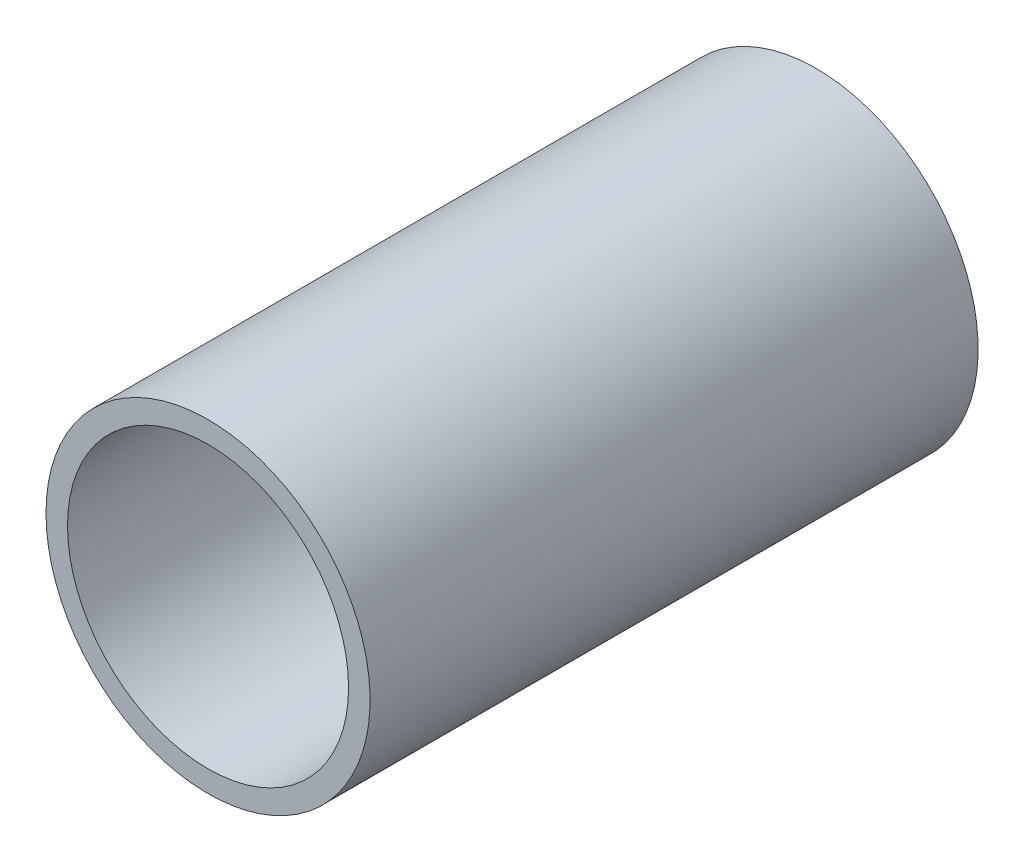
ISO-10303-21;
HEADER;
FILE_DESCRIPTION(('STEP AP214'),'2;1');
FILE_NAME('part.step','',(''),(''),'','','');
FILE_SCHEMA(('AUTOMOTIVE_DESIGN { 1 0 10303 214 1 1 1 1 }'));
ENDSEC;
DATA;
#1=APPLICATION_CONTEXT('core data for automotive mechanical design processes');
#2=APPLICATION_PROTOCOL_DEFINITION('international standard','automotive_design',2000,#1);
#3=PRODUCT_CONTEXT('',#1,'mechanical');
#4=PRODUCT('Part','Part','',(#3));
#5=PRODUCT_RELATED_PRODUCT_CATEGORY('part','',(#4));
#6=PRODUCT_DEFINITION_FORMATION('','',#4);
#7=PRODUCT_DEFINITION_CONTEXT('part definition',#1,'design');
#8=PRODUCT_DEFINITION('design','',#6,#7);
#9=PRODUCT_DEFINITION_SHAPE('','',#8);
#10=(LENGTH_UNIT() NAMED_UNIT(*) SI_UNIT(.MILLI.,.METRE.));
#11=(NAMED_UNIT(*) PLANE_ANGLE_UNIT() SI_UNIT($,.RADIAN.));
#12=(NAMED_UNIT(*) SI_UNIT($,.STERADIAN.) SOLID_ANGLE_UNIT());
#13=UNCERTAINTY_MEASURE_WITH_UNIT(LENGTH_MEASURE(1.E-05),#10,'distance_accuracy_value','');
#14=(GEOMETRIC_REPRESENTATION_CONTEXT(3) GLOBAL_UNCERTAINTY_ASSIGNED_CONTEXT((#13)) GLOBAL_UNIT_ASSIGNED_CONTEXT((#10,
#11,#12)) REPRESENTATION_CONTEXT('',''));
#15=CARTESIAN_POINT('',(0.,0.,0.));
#16=DIRECTION('',(0.,0.,1.));
#17=DIRECTION('',(1.,0.,0.));
#18=AXIS2_PLACEMENT_3D('',#15,#16,#17);
#19=CARTESIAN_POINT('',(0.,0.,12.9083954545455));
#20=DIRECTION('',(0.,0.,-1.));
#21=DIRECTION('',(-1.,0.,0.));
#22=AXIS2_PLACEMENT_3D('',#19,#20,#21);
#23=CYLINDRICAL_SURFACE('',#22,4.8133);
#24=CARTESIAN_POINT('',(0.,0.,-7.91960454545454));
#25=DIRECTION('',(0.,0.,-1.));
#26=DIRECTION('',(-1.,0.,0.));
#27=AXIS2_PLACEMENT_3D('',#24,#25,#26);
#28=CIRCLE('',#27,4.8133);
#29=CARTESIAN_POINT('',(-4.8133,0.,-7.91960454545454));
#30=VERTEX_POINT('',#29);
#31=EDGE_CURVE('E27',#30,#30,#28,.F.);
#32=ORIENTED_EDGE('',*,*,#31,.F.);
#33=EDGE_LOOP('',(#32));
#34=FACE_BOUND('',#33,.T.);
#35=CARTESIAN_POINT('',(0.,0.,12.9083954545455));
#36=DIRECTION('',(0.,0.,-1.));
#37=DIRECTION('',(-1.,0.,0.));
#38=AXIS2_PLACEMENT_3D('',#35,#36,#37);
#39=CIRCLE('',#38,4.8133);
#40=CARTESIAN_POINT('',(-4.8133,0.,12.9083954545455));
#41=VERTEX_POINT('',#40);
#42=EDGE_CURVE('E18',#41,#41,#39,.T.);
#43=ORIENTED_EDGE('',*,*,#42,.F.);
#44=EDGE_LOOP('',(#43));
#45=FACE_BOUND('',#44,.T.);
#46=ADVANCED_FACE('F15',(#34,#45),#23,.F.);
#47=CARTESIAN_POINT('',(5.54990000000001,0.,12.9083954545455));
#48=DIRECTION('',(0.,0.,1.));
#49=DIRECTION('',(1.,0.,0.));
#50=AXIS2_PLACEMENT_3D('',#47,#48,#49);
#51=PLANE('',#50);
#52=CARTESIAN_POINT('',(0.,0.,12.9083954545455));
#53=DIRECTION('',(0.,0.,-1.));
#54=DIRECTION('',(-1.,0.,0.));
#55=AXIS2_PLACEMENT_3D('',#52,#53,#54);
#56=CIRCLE('',#55,5.5499);
#57=CARTESIAN_POINT('',(-5.5499,0.,12.9083954545455));
#58=VERTEX_POINT('',#57);
#59=EDGE_CURVE('E22',#58,#58,#56,.T.);
#60=ORIENTED_EDGE('',*,*,#59,.F.);
#61=EDGE_LOOP('',(#60));
#62=FACE_BOUND('',#61,.T.);
#63=ORIENTED_EDGE('',*,*,#42,.T.);
#64=EDGE_LOOP('',(#63));
#65=FACE_BOUND('',#64,.T.);
#66=ADVANCED_FACE('F35',(#62,#65),#51,.T.);
#67=CARTESIAN_POINT('',(4.81330000000001,0.,-7.91960454545454));
#68=DIRECTION('',(0.,0.,-1.));
#69=DIRECTION('',(-1.,0.,0.));
#70=AXIS2_PLACEMENT_3D('',#67,#68,#69);
#71=PLANE('',#70);
#72=ORIENTED_EDGE('',*,*,#31,.T.);
#73=EDGE_LOOP('',(#72));
#74=FACE_BOUND('',#73,.T.);
#75=CARTESIAN_POINT('',(0.,0.,-7.91960454545454));
#76=DIRECTION('',(0.,0.,-1.));
#77=DIRECTION('',(-1.,0.,0.));
#78=AXIS2_PLACEMENT_3D('',#75,#76,#77);
#79=CIRCLE('',#78,5.5499);
#80=CARTESIAN_POINT('',(-5.5499,0.,-7.91960454545454));
#81=VERTEX_POINT('',#80);
#82=EDGE_CURVE('E10',#81,#81,#79,.F.);
#83=ORIENTED_EDGE('',*,*,#82,.F.);
#84=EDGE_LOOP('',(#83));
#85=FACE_BOUND('',#84,.T.);
#86=ADVANCED_FACE('F43',(#74,#85),#71,.T.);
#87=CARTESIAN_POINT('',(0.,0.,12.9083954545455));
#88=DIRECTION('',(0.,0.,-1.));
#89=DIRECTION('',(-1.,0.,0.));
#90=AXIS2_PLACEMENT_3D('',#87,#88,#89);
#91=CYLINDRICAL_SURFACE('',#90,5.5499);
#92=ORIENTED_EDGE('',*,*,#82,.T.);
#93=EDGE_LOOP('',(#92));
#94=FACE_BOUND('',#93,.T.);
#95=ORIENTED_EDGE('',*,*,#59,.T.);
#96=EDGE_LOOP('',(#95));
#97=FACE_BOUND('',#96,.T.);
#98=ADVANCED_FACE('F45',(#94,#97),#91,.T.);
#99=CLOSED_SHELL('',(#46,#66,#86,#98));
#100=MANIFOLD_SOLID_BREP('B1',#99);
#101=ADVANCED_BREP_SHAPE_REPRESENTATION('',(#18,#100),#14);
#102=SHAPE_DEFINITION_REPRESENTATION(#9,#101);
ENDSEC;
END-ISO-10303-21;
